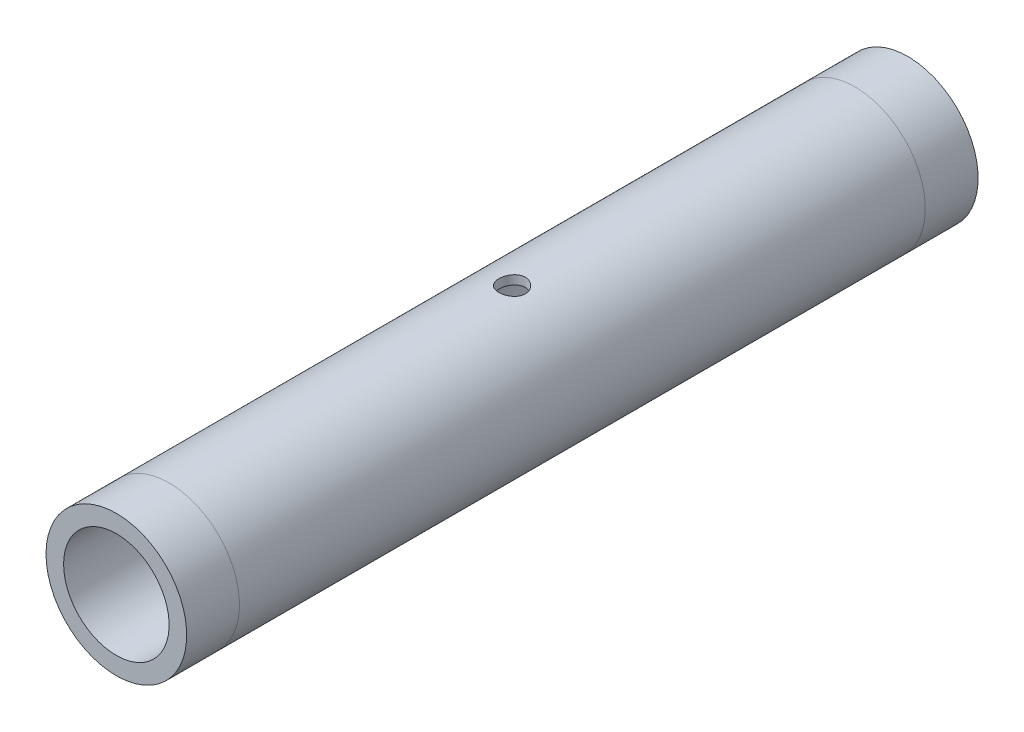
ISO-10303-21;
HEADER;
FILE_DESCRIPTION(('STEP AP214'),'2;1');
FILE_NAME('part.step','',(''),(''),'','','');
FILE_SCHEMA(('AUTOMOTIVE_DESIGN { 1 0 10303 214 1 1 1 1 }'));
ENDSEC;
DATA;
#1=APPLICATION_CONTEXT('core data for automotive mechanical design processes');
#2=APPLICATION_PROTOCOL_DEFINITION('international standard','automotive_design',2000,#1);
#3=PRODUCT_CONTEXT('',#1,'mechanical');
#4=PRODUCT('Part','Part','',(#3));
#5=PRODUCT_RELATED_PRODUCT_CATEGORY('part','',(#4));
#6=PRODUCT_DEFINITION_FORMATION('','',#4);
#7=PRODUCT_DEFINITION_CONTEXT('part definition',#1,'design');
#8=PRODUCT_DEFINITION('design','',#6,#7);
#9=PRODUCT_DEFINITION_SHAPE('','',#8);
#10=(LENGTH_UNIT() NAMED_UNIT(*) SI_UNIT(.MILLI.,.METRE.));
#11=(NAMED_UNIT(*) PLANE_ANGLE_UNIT() SI_UNIT($,.RADIAN.));
#12=(NAMED_UNIT(*) SI_UNIT($,.STERADIAN.) SOLID_ANGLE_UNIT());
#13=UNCERTAINTY_MEASURE_WITH_UNIT(LENGTH_MEASURE(1.E-05),#10,'distance_accuracy_value','');
#14=(GEOMETRIC_REPRESENTATION_CONTEXT(3) GLOBAL_UNCERTAINTY_ASSIGNED_CONTEXT((#13)) GLOBAL_UNIT_ASSIGNED_CONTEXT((#10,
#11,#12)) REPRESENTATION_CONTEXT('',''));
#15=CARTESIAN_POINT('',(0.,0.,0.));
#16=DIRECTION('',(0.,0.,1.));
#17=DIRECTION('',(1.,0.,0.));
#18=AXIS2_PLACEMENT_3D('',#15,#16,#17);
#19=CARTESIAN_POINT('',(0.,0.,0.));
#20=DIRECTION('',(0.,0.,-1.));
#21=DIRECTION('',(-1.,0.,0.));
#22=AXIS2_PLACEMENT_3D('',#19,#20,#21);
#23=CYLINDRICAL_SURFACE('',#22,4.);
#24=CARTESIAN_POINT('',(0.,0.,-22.5));
#25=DIRECTION('',(0.,0.,-1.));
#26=DIRECTION('',(-1.,0.,0.));
#27=AXIS2_PLACEMENT_3D('',#24,#25,#26);
#28=CIRCLE('',#27,4.);
#29=CARTESIAN_POINT('',(-4.,0.,-22.5));
#30=VERTEX_POINT('',#29);
#31=EDGE_CURVE('E68',#30,#30,#28,.T.);
#32=ORIENTED_EDGE('',*,*,#31,.F.);
#33=EDGE_LOOP('',(#32));
#34=FACE_BOUND('',#33,.T.);
#35=CARTESIAN_POINT('',(0.,0.,-19.5));
#36=DIRECTION('',(0.,0.,-1.));
#37=DIRECTION('',(-1.,0.,0.));
#38=AXIS2_PLACEMENT_3D('',#35,#36,#37);
#39=CIRCLE('',#38,4.);
#40=CARTESIAN_POINT('',(-4.,0.,-19.5));
#41=VERTEX_POINT('',#40);
#42=EDGE_CURVE('E11',#41,#41,#39,.T.);
#43=ORIENTED_EDGE('',*,*,#42,.T.);
#44=EDGE_LOOP('',(#43));
#45=FACE_BOUND('',#44,.T.);
#46=ADVANCED_FACE('F46',(#34,#45),#23,.T.);
#47=CARTESIAN_POINT('',(0.,0.,-19.5));
#48=DIRECTION('',(0.,0.,1.));
#49=DIRECTION('',(1.,0.,0.));
#50=AXIS2_PLACEMENT_3D('',#47,#48,#49);
#51=PLANE('',#50);
#52=CARTESIAN_POINT('',(0.,0.,-19.5));
#53=DIRECTION('',(0.,0.,-1.));
#54=DIRECTION('',(-1.,0.,0.));
#55=AXIS2_PLACEMENT_3D('',#52,#53,#54);
#56=CIRCLE('',#55,3.5);
#57=CARTESIAN_POINT('',(-3.5,0.,-19.5));
#58=VERTEX_POINT('',#57);
#59=EDGE_CURVE('E52',#58,#58,#56,.T.);
#60=ORIENTED_EDGE('',*,*,#59,.T.);
#61=EDGE_LOOP('',(#60));
#62=FACE_BOUND('',#61,.T.);
#63=ORIENTED_EDGE('',*,*,#42,.F.);
#64=EDGE_LOOP('',(#63));
#65=FACE_BOUND('',#64,.T.);
#66=ADVANCED_FACE('F75',(#62,#65),#51,.T.);
#67=CARTESIAN_POINT('',(0.,0.,0.));
#68=DIRECTION('',(0.,0.,-1.));
#69=DIRECTION('',(-1.,0.,0.));
#70=AXIS2_PLACEMENT_3D('',#67,#68,#69);
#71=CYLINDRICAL_SURFACE('',#70,3.5);
#72=ORIENTED_EDGE('',*,*,#59,.F.);
#73=EDGE_LOOP('',(#72));
#74=FACE_BOUND('',#73,.T.);
#75=CARTESIAN_POINT('',(0.,0.,-16.5));
#76=DIRECTION('',(0.,0.,-1.));
#77=DIRECTION('',(-1.,0.,0.));
#78=AXIS2_PLACEMENT_3D('',#75,#76,#77);
#79=CIRCLE('',#78,3.5);
#80=CARTESIAN_POINT('',(-3.5,0.,-16.5));
#81=VERTEX_POINT('',#80);
#82=EDGE_CURVE('E56',#81,#81,#79,.T.);
#83=ORIENTED_EDGE('',*,*,#82,.T.);
#84=EDGE_LOOP('',(#83));
#85=FACE_BOUND('',#84,.T.);
#86=ADVANCED_FACE('F79',(#74,#85),#71,.T.);
#87=CARTESIAN_POINT('',(0.,0.,-16.5));
#88=DIRECTION('',(0.,0.,-1.));
#89=DIRECTION('',(-1.,0.,0.));
#90=AXIS2_PLACEMENT_3D('',#87,#88,#89);
#91=PLANE('',#90);
#92=ORIENTED_EDGE('',*,*,#82,.F.);
#93=EDGE_LOOP('',(#92));
#94=FACE_BOUND('',#93,.T.);
#95=CARTESIAN_POINT('',(0.,0.,-16.5));
#96=DIRECTION('',(0.,0.,-1.));
#97=DIRECTION('',(-1.,0.,0.));
#98=AXIS2_PLACEMENT_3D('',#95,#96,#97);
#99=CIRCLE('',#98,3.);
#100=CARTESIAN_POINT('',(-3.,0.,-16.5));
#101=VERTEX_POINT('',#100);
#102=EDGE_CURVE('E60',#101,#101,#99,.T.);
#103=ORIENTED_EDGE('',*,*,#102,.T.);
#104=EDGE_LOOP('',(#103));
#105=FACE_BOUND('',#104,.T.);
#106=ADVANCED_FACE('F83',(#94,#105),#91,.F.);
#107=CARTESIAN_POINT('',(0.,0.,0.));
#108=DIRECTION('',(0.,0.,-1.));
#109=DIRECTION('',(-1.,0.,0.));
#110=AXIS2_PLACEMENT_3D('',#107,#108,#109);
#111=CYLINDRICAL_SURFACE('',#110,3.);
#112=ORIENTED_EDGE('',*,*,#102,.F.);
#113=EDGE_LOOP('',(#112));
#114=FACE_BOUND('',#113,.T.);
#115=CARTESIAN_POINT('',(0.,0.,-22.5));
#116=DIRECTION('',(0.,0.,-1.));
#117=DIRECTION('',(-1.,0.,0.));
#118=AXIS2_PLACEMENT_3D('',#115,#116,#117);
#119=CIRCLE('',#118,3.);
#120=CARTESIAN_POINT('',(-3.,0.,-22.5));
#121=VERTEX_POINT('',#120);
#122=EDGE_CURVE('E65',#121,#121,#119,.T.);
#123=ORIENTED_EDGE('',*,*,#122,.T.);
#124=EDGE_LOOP('',(#123));
#125=FACE_BOUND('',#124,.T.);
#126=ADVANCED_FACE('F90',(#114,#125),#111,.F.);
#127=CARTESIAN_POINT('',(0.,0.,-22.5));
#128=DIRECTION('',(0.,0.,1.));
#129=DIRECTION('',(1.,0.,0.));
#130=AXIS2_PLACEMENT_3D('',#127,#128,#129);
#131=PLANE('',#130);
#132=ORIENTED_EDGE('',*,*,#122,.F.);
#133=EDGE_LOOP('',(#132));
#134=FACE_BOUND('',#133,.T.);
#135=ORIENTED_EDGE('',*,*,#31,.T.);
#136=EDGE_LOOP('',(#135));
#137=FACE_BOUND('',#136,.T.);
#138=ADVANCED_FACE('F72',(#134,#137),#131,.F.);
#139=CLOSED_SHELL('',(#46,#66,#86,#106,#126,#138));
#140=MANIFOLD_SOLID_BREP('B2',#139);
#141=CARTESIAN_POINT('',(0.,0.,0.));
#142=DIRECTION('',(0.,0.,-1.));
#143=DIRECTION('',(-1.,0.,0.));
#144=AXIS2_PLACEMENT_3D('',#141,#142,#143);
#145=CYLINDRICAL_SURFACE('',#144,3.);
#146=CARTESIAN_POINT('',(0.,0.,16.5));
#147=DIRECTION('',(0.,0.,-1.));
#148=DIRECTION('',(-1.,0.,0.));
#149=AXIS2_PLACEMENT_3D('',#146,#147,#148);
#150=CIRCLE('',#149,3.);
#151=CARTESIAN_POINT('',(-3.,0.,16.5));
#152=VERTEX_POINT('',#151);
#153=EDGE_CURVE('E45',#152,#152,#150,.T.);
#154=ORIENTED_EDGE('',*,*,#153,.T.);
#155=EDGE_LOOP('',(#154));
#156=FACE_BOUND('',#155,.T.);
#157=CARTESIAN_POINT('',(0.,0.,22.5));
#158=DIRECTION('',(0.,0.,-1.));
#159=DIRECTION('',(-1.,0.,0.));
#160=AXIS2_PLACEMENT_3D('',#157,#158,#159);
#161=CIRCLE('',#160,3.);
#162=CARTESIAN_POINT('',(-3.,0.,22.5));
#163=VERTEX_POINT('',#162);
#164=EDGE_CURVE('E175',#163,#163,#161,.T.);
#165=ORIENTED_EDGE('',*,*,#164,.F.);
#166=EDGE_LOOP('',(#165));
#167=FACE_BOUND('',#166,.T.);
#168=ADVANCED_FACE('F148',(#156,#167),#145,.F.);
#169=CARTESIAN_POINT('',(0.,0.,16.5));
#170=DIRECTION('',(0.,0.,-1.));
#171=DIRECTION('',(-1.,0.,0.));
#172=AXIS2_PLACEMENT_3D('',#169,#170,#171);
#173=PLANE('',#172);
#174=CARTESIAN_POINT('',(0.,0.,16.5));
#175=DIRECTION('',(0.,0.,-1.));
#176=DIRECTION('',(-1.,0.,0.));
#177=AXIS2_PLACEMENT_3D('',#174,#175,#176);
#178=CIRCLE('',#177,3.5);
#179=CARTESIAN_POINT('',(-3.5,0.,16.5));
#180=VERTEX_POINT('',#179);
#181=EDGE_CURVE('E155',#180,#180,#178,.T.);
#182=ORIENTED_EDGE('',*,*,#181,.T.);
#183=EDGE_LOOP('',(#182));
#184=FACE_BOUND('',#183,.T.);
#185=ORIENTED_EDGE('',*,*,#153,.F.);
#186=EDGE_LOOP('',(#185));
#187=FACE_BOUND('',#186,.T.);
#188=ADVANCED_FACE('F184',(#184,#187),#173,.T.);
#189=CARTESIAN_POINT('',(0.,0.,0.));
#190=DIRECTION('',(0.,0.,-1.));
#191=DIRECTION('',(-1.,0.,0.));
#192=AXIS2_PLACEMENT_3D('',#189,#190,#191);
#193=CYLINDRICAL_SURFACE('',#192,3.5);
#194=ORIENTED_EDGE('',*,*,#181,.F.);
#195=EDGE_LOOP('',(#194));
#196=FACE_BOUND('',#195,.T.);
#197=CARTESIAN_POINT('',(0.,0.,19.5));
#198=DIRECTION('',(0.,0.,-1.));
#199=DIRECTION('',(-1.,0.,0.));
#200=AXIS2_PLACEMENT_3D('',#197,#198,#199);
#201=CIRCLE('',#200,3.5);
#202=CARTESIAN_POINT('',(-3.5,0.,19.5));
#203=VERTEX_POINT('',#202);
#204=EDGE_CURVE('E161',#203,#203,#201,.T.);
#205=ORIENTED_EDGE('',*,*,#204,.T.);
#206=EDGE_LOOP('',(#205));
#207=FACE_BOUND('',#206,.T.);
#208=ADVANCED_FACE('F188',(#196,#207),#193,.T.);
#209=CARTESIAN_POINT('',(0.,0.,19.5));
#210=DIRECTION('',(0.,0.,1.));
#211=DIRECTION('',(1.,0.,0.));
#212=AXIS2_PLACEMENT_3D('',#209,#210,#211);
#213=PLANE('',#212);
#214=ORIENTED_EDGE('',*,*,#204,.F.);
#215=EDGE_LOOP('',(#214));
#216=FACE_BOUND('',#215,.T.);
#217=CARTESIAN_POINT('',(0.,0.,19.5));
#218=DIRECTION('',(0.,0.,-1.));
#219=DIRECTION('',(-1.,0.,0.));
#220=AXIS2_PLACEMENT_3D('',#217,#218,#219);
#221=CIRCLE('',#220,4.);
#222=CARTESIAN_POINT('',(-4.,0.,19.5));
#223=VERTEX_POINT('',#222);
#224=EDGE_CURVE('E166',#223,#223,#221,.T.);
#225=ORIENTED_EDGE('',*,*,#224,.T.);
#226=EDGE_LOOP('',(#225));
#227=FACE_BOUND('',#226,.T.);
#228=ADVANCED_FACE('F192',(#216,#227),#213,.F.);
#229=CARTESIAN_POINT('',(0.,0.,0.));
#230=DIRECTION('',(0.,0.,-1.));
#231=DIRECTION('',(-1.,0.,0.));
#232=AXIS2_PLACEMENT_3D('',#229,#230,#231);
#233=CYLINDRICAL_SURFACE('',#232,4.);
#234=CARTESIAN_POINT('',(0.,0.,22.5));
#235=DIRECTION('',(0.,0.,-1.));
#236=DIRECTION('',(-1.,0.,0.));
#237=AXIS2_PLACEMENT_3D('',#234,#235,#236);
#238=CIRCLE('',#237,4.);
#239=CARTESIAN_POINT('',(-4.,0.,22.5));
#240=VERTEX_POINT('',#239);
#241=EDGE_CURVE('E171',#240,#240,#238,.T.);
#242=ORIENTED_EDGE('',*,*,#241,.T.);
#243=EDGE_LOOP('',(#242));
#244=FACE_BOUND('',#243,.T.);
#245=ORIENTED_EDGE('',*,*,#224,.F.);
#246=EDGE_LOOP('',(#245));
#247=FACE_BOUND('',#246,.T.);
#248=ADVANCED_FACE('F199',(#244,#247),#233,.T.);
#249=CARTESIAN_POINT('',(0.,0.,22.5));
#250=DIRECTION('',(0.,0.,1.));
#251=DIRECTION('',(1.,0.,0.));
#252=AXIS2_PLACEMENT_3D('',#249,#250,#251);
#253=PLANE('',#252);
#254=ORIENTED_EDGE('',*,*,#164,.T.);
#255=EDGE_LOOP('',(#254));
#256=FACE_BOUND('',#255,.T.);
#257=ORIENTED_EDGE('',*,*,#241,.F.);
#258=EDGE_LOOP('',(#257));
#259=FACE_BOUND('',#258,.T.);
#260=ADVANCED_FACE('F180',(#256,#259),#253,.T.);
#261=CLOSED_SHELL('',(#168,#188,#208,#228,#248,#260));
#262=MANIFOLD_SOLID_BREP('B6',#261);
#263=CARTESIAN_POINT('',(0.,0.,0.));
#264=DIRECTION('',(0.,0.,-1.));
#265=DIRECTION('',(-1.,0.,0.));
#266=AXIS2_PLACEMENT_3D('',#263,#264,#265);
#267=CYLINDRICAL_SURFACE('',#266,4.);
#268=CARTESIAN_POINT('',(0.,0.,-19.5));
#269=DIRECTION('',(0.,0.,-1.));
#270=DIRECTION('',(-1.,0.,0.));
#271=AXIS2_PLACEMENT_3D('',#268,#269,#270);
#272=CIRCLE('',#271,4.);
#273=CARTESIAN_POINT('',(-4.,0.,-19.5));
#274=VERTEX_POINT('',#273);
#275=EDGE_CURVE('E147',#274,#274,#272,.T.);
#276=ORIENTED_EDGE('',*,*,#275,.F.);
#277=EDGE_LOOP('',(#276));
#278=FACE_BOUND('',#277,.T.);
#279=CARTESIAN_POINT('',(0.,0.,19.5));
#280=DIRECTION('',(0.,0.,-1.));
#281=DIRECTION('',(-1.,0.,0.));
#282=AXIS2_PLACEMENT_3D('',#279,#280,#281);
#283=CIRCLE('',#282,4.);
#284=CARTESIAN_POINT('',(-4.,0.,19.5));
#285=VERTEX_POINT('',#284);
#286=EDGE_CURVE('E264',#285,#285,#283,.T.);
#287=ORIENTED_EDGE('',*,*,#286,.T.);
#288=EDGE_LOOP('',(#287));
#289=FACE_BOUND('',#288,.T.);
#290=CARTESIAN_POINT('',(0.,-4.,-0.75));
#291=CARTESIAN_POINT('',(0.0417358732327354,-3.99999924416926,-0.749998405205862));
#292=CARTESIAN_POINT('',(0.0834924963650491,-3.99934004960857,-0.74650446169031));
#293=CARTESIAN_POINT('',(0.165829064920899,-3.9967739294526,-0.732630002440827));
#294=CARTESIAN_POINT('',(0.206407987076113,-3.99486595083449,-0.722243674680133));
#295=CARTESIAN_POINT('',(0.285186480925901,-3.99001569382729,-0.694913649370329));
#296=CARTESIAN_POINT('',(0.323388165342672,-3.98707434973241,-0.677975873773729));
#297=CARTESIAN_POINT('',(0.396403986547003,-3.98047855299892,-0.638040561538592));
#298=CARTESIAN_POINT('',(0.431218397238661,-3.97682415809145,-0.615043515427591));
#299=CARTESIAN_POINT('',(0.496891857965251,-3.96915668215252,-0.563350115998163));
#300=CARTESIAN_POINT('',(0.527704477515916,-3.96514017428176,-0.534595277664932));
#301=CARTESIAN_POINT('',(0.584098030676846,-3.95722659229325,-0.47232834545622));
#302=CARTESIAN_POINT('',(0.609678588446207,-3.95332952677264,-0.438815910115357));
#303=CARTESIAN_POINT('',(0.655074993328964,-3.94606275622503,-0.367656955818015));
#304=CARTESIAN_POINT('',(0.674843609848026,-3.94269746943091,-0.329979814841382));
#305=CARTESIAN_POINT('',(0.707752621661415,-3.93692356605994,-0.251765542411605));
#306=CARTESIAN_POINT('',(0.720893588565491,-3.93451486698481,-0.211228657944392));
#307=CARTESIAN_POINT('',(0.740025267517501,-3.93096134787275,-0.128942384542795));
#308=CARTESIAN_POINT('',(0.746096950960195,-3.92980222683202,-0.0872124513982682));
#309=CARTESIAN_POINT('',(0.751169040476732,-3.92883598576381,-0.00331130759587624));
#310=CARTESIAN_POINT('',(0.75017008067687,-3.9290287444938,0.0388598631511506));
#311=CARTESIAN_POINT('',(0.741194898011812,-3.93073146350876,0.121859762633023));
#312=CARTESIAN_POINT('',(0.733310749980224,-3.93222404073667,0.162698857150077));
#313=CARTESIAN_POINT('',(0.710933996981035,-3.93633091642333,0.242464209891304));
#314=CARTESIAN_POINT('',(0.696441111197497,-3.93894526254758,0.28139038675465));
#315=CARTESIAN_POINT('',(0.661168235896499,-3.94501927646294,0.356494339500132));
#316=CARTESIAN_POINT('',(0.640351067662279,-3.94848391911683,0.392654235290404));
#317=CARTESIAN_POINT('',(0.593046844652081,-3.95586485801459,0.461002364270116));
#318=CARTESIAN_POINT('',(0.56655921444633,-3.95978120007761,0.4931901938574));
#319=CARTESIAN_POINT('',(0.508169528426488,-3.96770000636082,0.553212477836229));
#320=CARTESIAN_POINT('',(0.476188718430341,-3.97170285512015,0.580970326225871));
#321=CARTESIAN_POINT('',(0.407984018549413,-3.97928693054159,0.630738620337702));
#322=CARTESIAN_POINT('',(0.371760086127885,-3.98286815297623,0.65274900843521));
#323=CARTESIAN_POINT('',(0.296017494437334,-3.98921269838755,0.690408876935009));
#324=CARTESIAN_POINT('',(0.256494782223247,-3.99197499568145,0.706050389558947));
#325=CARTESIAN_POINT('',(0.175319557699348,-3.9963625270136,0.73045104654608));
#326=CARTESIAN_POINT('',(0.133667272138894,-3.99798788183997,0.739210922022678));
#327=CARTESIAN_POINT('',(0.0500743264516928,-3.9999018032099,0.749493015509135));
#328=CARTESIAN_POINT('',(0.0081470063170679,-4.00020975456139,0.751120195764863));
#329=CARTESIAN_POINT('',(-0.0753806240460917,-3.99950771799114,0.747372260226176));
#330=CARTESIAN_POINT('',(-0.116980950240192,-3.99849779482216,0.741997488467371));
#331=CARTESIAN_POINT('',(-0.198340786609108,-3.99528555750203,0.724485482408316));
#332=CARTESIAN_POINT('',(-0.238112130523031,-3.99309261187016,0.712401358731093));
#333=CARTESIAN_POINT('',(-0.315064315912316,-3.98775921106249,0.681871146610607));
#334=CARTESIAN_POINT('',(-0.352244981297551,-3.98461869155667,0.663424626217107));
#335=CARTESIAN_POINT('',(-0.423408335756607,-3.97769015178833,0.620460935920244));
#336=CARTESIAN_POINT('',(-0.45735163850756,-3.97389543087282,0.595879630731581));
#337=CARTESIAN_POINT('',(-0.520669161632272,-3.96609671744856,0.541430931318821));
#338=CARTESIAN_POINT('',(-0.550042954880433,-3.96209270542344,0.511563043499335));
#339=CARTESIAN_POINT('',(-0.603786479360239,-3.95426237848725,0.446913840544287));
#340=CARTESIAN_POINT('',(-0.628084581092883,-3.95043912930129,0.412072545937307));
#341=CARTESIAN_POINT('',(-0.670483375288934,-3.94346492789266,0.338741187738125));
#342=CARTESIAN_POINT('',(-0.68858429806962,-3.94031395068675,0.300251259814764));
#343=CARTESIAN_POINT('',(-0.717973367564115,-3.93506512104787,0.220897066378732));
#344=CARTESIAN_POINT('',(-0.729294343973931,-3.93296220218439,0.180045310220334));
#345=CARTESIAN_POINT('',(-0.744903396631177,-3.93003601901208,0.0969763887392993));
#346=CARTESIAN_POINT('',(-0.749192266353541,-3.92921261032895,0.0547593780147994));
#347=CARTESIAN_POINT('',(-0.750588810741773,-3.92894599901929,-0.0291241657207564));
#348=CARTESIAN_POINT('',(-0.747809475017494,-3.92948107987147,-0.0707887904784978));
#349=CARTESIAN_POINT('',(-0.735395876894015,-3.93182300329999,-0.153045711022644));
#350=CARTESIAN_POINT('',(-0.72576165544666,-3.93362983827873,-0.19363801321372));
#351=CARTESIAN_POINT('',(-0.699959437916316,-3.9383025401159,-0.27253724239774));
#352=CARTESIAN_POINT('',(-0.683803676986262,-3.94116642297482,-0.310848295672885));
#353=CARTESIAN_POINT('',(-0.645429344561021,-3.9476319377592,-0.384234127120422));
#354=CARTESIAN_POINT('',(-0.623210344740928,-3.9512336218006,-0.419308676422391));
#355=CARTESIAN_POINT('',(-0.572947436697675,-3.95883633053873,-0.485791840021147));
#356=CARTESIAN_POINT('',(-0.544821299321517,-3.96284252676522,-0.517137706283552));
#357=CARTESIAN_POINT('',(-0.483713963371145,-3.97076416959368,-0.574702581232262));
#358=CARTESIAN_POINT('',(-0.450731650945808,-3.97467959513664,-0.600920410490068));
#359=CARTESIAN_POINT('',(-0.380492472535936,-3.98201987984024,-0.64770547631353));
#360=CARTESIAN_POINT('',(-0.343199795320258,-3.98544000495281,-0.668219714245319));
#361=CARTESIAN_POINT('',(-0.265645056826917,-3.99135809690343,-0.702658818302567));
#362=CARTESIAN_POINT('',(-0.225385825852624,-3.99385692939519,-0.716589873523454));
#363=CARTESIAN_POINT('',(-0.154173601412577,-3.99714145353816,-0.734638657209337));
#364=CARTESIAN_POINT('',(-0.123636905125936,-3.99820735439103,-0.7403893151564));
#365=CARTESIAN_POINT('',(-0.0620706235575794,-3.99963689977005,-0.748070531058224));
#366=CARTESIAN_POINT('',(-0.0310410508263549,-4.00000056214903,-0.750001186127954));
#367=CARTESIAN_POINT('',(0.,-4.,-0.75));
#368=B_SPLINE_CURVE_WITH_KNOTS('',3,(#290,#291,#292,#293,#294,#295,#296,#297,#298,#299,#300,
#301,#302,#303,#304,#305,#306,#307,#308,#309,#310,#311,#312,#313,#314,#315,#316,#317,#318,#319,
#320,#321,#322,#323,#324,#325,#326,#327,#328,#329,#330,#331,#332,#333,#334,#335,#336,#337,#338,
#339,#340,#341,#342,#343,#344,#345,#346,#347,#348,#349,#350,#351,#352,#353,#354,#355,#356,#357,
#358,#359,#360,#361,#362,#363,#364,#365,#366,#367),.UNSPECIFIED.,.T.,.F.,(4,2,2,2,2,2,2,2,2,2,2,
2,2,2,2,2,2,2,2,2,2,2,2,2,2,2,2,2,2,2,2,2,2,2,2,2,2,2,4),(0.,0.125094100482462,
0.250293821267726,0.375380635615454,0.500457326684454,0.626875590068152,0.753302931418083,
0.880730952521787,1.00814798155974,1.13409075722668,1.26002223793628,1.38429500306383,
1.50857304923393,1.63359631314765,1.7586322702493,1.88563884232038,2.01264668772474,
2.13981294160849,2.26696568336873,2.39224087038048,2.51750990232292,2.64180116953914,
2.76610087669016,2.89175889008854,3.01742864206549,3.14476718493649,3.27210099477473,
3.3988131390928,3.52551098473256,3.65019626115874,3.77488079270753,3.89933248103846,
4.02379296327712,4.1501168498319,4.27646975631128,4.40396024458157,4.53133063465587,
4.62437172262205,4.7174104451977),.UNSPECIFIED.);
#369=CARTESIAN_POINT('',(0.,-4.,-0.75));
#370=VERTEX_POINT('',#369);
#371=EDGE_CURVE('E290',#370,#370,#368,.T.);
#372=ORIENTED_EDGE('',*,*,#371,.F.);
#373=EDGE_LOOP('',(#372));
#374=FACE_BOUND('',#373,.T.);
#375=CARTESIAN_POINT('',(0.,4.,-0.75));
#376=CARTESIAN_POINT('',(-0.0417358732327354,3.99999924416926,-0.749998405205862));
#377=CARTESIAN_POINT('',(-0.0834924963650493,3.99934004960857,-0.74650446169031));
#378=CARTESIAN_POINT('',(-0.165829064920899,3.9967739294526,-0.732630002440827));
#379=CARTESIAN_POINT('',(-0.206407987076113,3.99486595083449,-0.722243674680133));
#380=CARTESIAN_POINT('',(-0.285186480925901,3.99001569382729,-0.694913649370329));
#381=CARTESIAN_POINT('',(-0.323388165342672,3.98707434973241,-0.677975873773728));
#382=CARTESIAN_POINT('',(-0.396403986547003,3.98047855299892,-0.638040561538592));
#383=CARTESIAN_POINT('',(-0.431218397238662,3.97682415809145,-0.615043515427591));
#384=CARTESIAN_POINT('',(-0.496891857965252,3.96915668215252,-0.563350115998163));
#385=CARTESIAN_POINT('',(-0.527704477515916,3.96514017428176,-0.534595277664932));
#386=CARTESIAN_POINT('',(-0.584098030676846,3.95722659229325,-0.47232834545622));
#387=CARTESIAN_POINT('',(-0.609678588446208,3.95332952677264,-0.438815910115357));
#388=CARTESIAN_POINT('',(-0.655074993328964,3.94606275622503,-0.367656955818014));
#389=CARTESIAN_POINT('',(-0.674843609848027,3.94269746943091,-0.329979814841381));
#390=CARTESIAN_POINT('',(-0.707752621661415,3.93692356605994,-0.251765542411605));
#391=CARTESIAN_POINT('',(-0.720893588565491,3.93451486698481,-0.211228657944391));
#392=CARTESIAN_POINT('',(-0.740025267517501,3.93096134787275,-0.128942384542794));
#393=CARTESIAN_POINT('',(-0.746096950960195,3.92980222683202,-0.0872124513982675));
#394=CARTESIAN_POINT('',(-0.751169040476732,3.92883598576381,-0.00331130759587565));
#395=CARTESIAN_POINT('',(-0.75017008067687,3.9290287444938,0.0388598631511511));
#396=CARTESIAN_POINT('',(-0.741194898011812,3.93073146350876,0.121859762633023));
#397=CARTESIAN_POINT('',(-0.733310749980224,3.93222404073667,0.162698857150077));
#398=CARTESIAN_POINT('',(-0.710933996981035,3.93633091642333,0.242464209891305));
#399=CARTESIAN_POINT('',(-0.696441111197496,3.93894526254758,0.28139038675465));
#400=CARTESIAN_POINT('',(-0.661168235896499,3.94501927646294,0.356494339500133));
#401=CARTESIAN_POINT('',(-0.640351067662279,3.94848391911683,0.392654235290405));
#402=CARTESIAN_POINT('',(-0.593046844652081,3.95586485801459,0.461002364270117));
#403=CARTESIAN_POINT('',(-0.56655921444633,3.95978120007761,0.493190193857401));
#404=CARTESIAN_POINT('',(-0.508169528426488,3.96770000636082,0.55321247783623));
#405=CARTESIAN_POINT('',(-0.476188718430341,3.97170285512015,0.580970326225871));
#406=CARTESIAN_POINT('',(-0.407984018549413,3.97928693054159,0.630738620337703));
#407=CARTESIAN_POINT('',(-0.371760086127884,3.98286815297623,0.652749008435211));
#408=CARTESIAN_POINT('',(-0.296017494437334,3.98921269838755,0.690408876935009));
#409=CARTESIAN_POINT('',(-0.256494782223246,3.99197499568145,0.706050389558948));
#410=CARTESIAN_POINT('',(-0.175319557699348,3.9963625270136,0.73045104654608));
#411=CARTESIAN_POINT('',(-0.133667272138893,3.99798788183997,0.739210922022678));
#412=CARTESIAN_POINT('',(-0.0500743264516919,3.9999018032099,0.749493015509135));
#413=CARTESIAN_POINT('',(-0.0081470063170669,4.00020975456139,0.751120195764863));
#414=CARTESIAN_POINT('',(0.0753806240460927,3.99950771799114,0.747372260226176));
#415=CARTESIAN_POINT('',(0.116980950240193,3.99849779482216,0.74199748846737));
#416=CARTESIAN_POINT('',(0.198340786609109,3.99528555750203,0.724485482408316));
#417=CARTESIAN_POINT('',(0.238112130523032,3.99309261187016,0.712401358731093));
#418=CARTESIAN_POINT('',(0.315064315912317,3.98775921106249,0.681871146610606));
#419=CARTESIAN_POINT('',(0.352244981297552,3.98461869155667,0.663424626217107));
#420=CARTESIAN_POINT('',(0.423408335756607,3.97769015178833,0.620460935920244));
#421=CARTESIAN_POINT('',(0.457351638507561,3.97389543087282,0.59587963073158));
#422=CARTESIAN_POINT('',(0.520669161632273,3.96609671744856,0.541430931318821));
#423=CARTESIAN_POINT('',(0.550042954880433,3.96209270542344,0.511563043499335));
#424=CARTESIAN_POINT('',(0.603786479360239,3.95426237848725,0.446913840544287));
#425=CARTESIAN_POINT('',(0.628084581092883,3.95043912930129,0.412072545937307));
#426=CARTESIAN_POINT('',(0.670483375288934,3.94346492789266,0.338741187738124));
#427=CARTESIAN_POINT('',(0.688584298069621,3.94031395068675,0.300251259814763));
#428=CARTESIAN_POINT('',(0.717973367564115,3.93506512104787,0.220897066378732));
#429=CARTESIAN_POINT('',(0.729294343973931,3.93296220218439,0.180045310220333));
#430=CARTESIAN_POINT('',(0.744903396631177,3.93003601901208,0.0969763887392989));
#431=CARTESIAN_POINT('',(0.749192266353541,3.92921261032895,0.054759378014799));
#432=CARTESIAN_POINT('',(0.750588810741773,3.92894599901929,-0.0291241657207567));
#433=CARTESIAN_POINT('',(0.747809475017494,3.92948107987147,-0.070788790478498));
#434=CARTESIAN_POINT('',(0.735395876894015,3.93182300329999,-0.153045711022644));
#435=CARTESIAN_POINT('',(0.72576165544666,3.93362983827873,-0.193638013213721));
#436=CARTESIAN_POINT('',(0.699959437916316,3.9383025401159,-0.27253724239774));
#437=CARTESIAN_POINT('',(0.683803676986262,3.94116642297482,-0.310848295672885));
#438=CARTESIAN_POINT('',(0.645429344561021,3.9476319377592,-0.384234127120422));
#439=CARTESIAN_POINT('',(0.623210344740928,3.9512336218006,-0.419308676422391));
#440=CARTESIAN_POINT('',(0.572947436697675,3.95883633053873,-0.485791840021147));
#441=CARTESIAN_POINT('',(0.544821299321517,3.96284252676522,-0.517137706283551));
#442=CARTESIAN_POINT('',(0.483713963371145,3.97076416959368,-0.574702581232261));
#443=CARTESIAN_POINT('',(0.450731650945808,3.97467959513664,-0.600920410490069));
#444=CARTESIAN_POINT('',(0.380492472535936,3.98201987984024,-0.64770547631353));
#445=CARTESIAN_POINT('',(0.343199795320258,3.98544000495281,-0.668219714245319));
#446=CARTESIAN_POINT('',(0.265645056826917,3.99135809690343,-0.702658818302568));
#447=CARTESIAN_POINT('',(0.225385825852624,3.99385692939519,-0.716589873523454));
#448=CARTESIAN_POINT('',(0.154173601412577,3.99714145353816,-0.734638657209337));
#449=CARTESIAN_POINT('',(0.123636905125935,3.99820735439103,-0.740389315156401));
#450=CARTESIAN_POINT('',(0.0620706235575789,3.99963689977005,-0.748070531058224));
#451=CARTESIAN_POINT('',(0.0310410508263547,4.00000056214903,-0.750001186127954));
#452=CARTESIAN_POINT('',(0.,4.,-0.75));
#453=B_SPLINE_CURVE_WITH_KNOTS('',3,(#375,#376,#377,#378,#379,#380,#381,#382,#383,#384,#385,
#386,#387,#388,#389,#390,#391,#392,#393,#394,#395,#396,#397,#398,#399,#400,#401,#402,#403,#404,
#405,#406,#407,#408,#409,#410,#411,#412,#413,#414,#415,#416,#417,#418,#419,#420,#421,#422,#423,
#424,#425,#426,#427,#428,#429,#430,#431,#432,#433,#434,#435,#436,#437,#438,#439,#440,#441,#442,
#443,#444,#445,#446,#447,#448,#449,#450,#451,#452),.UNSPECIFIED.,.T.,.F.,(4,2,2,2,2,2,2,2,2,2,2,
2,2,2,2,2,2,2,2,2,2,2,2,2,2,2,2,2,2,2,2,2,2,2,2,2,2,2,4),(0.,0.125094100482462,
0.250293821267726,0.375380635615454,0.500457326684454,0.626875590068153,0.753302931418083,
0.880730952521788,1.00814798155974,1.13409075722668,1.26002223793628,1.38429500306383,
1.50857304923393,1.63359631314765,1.7586322702493,1.88563884232038,2.01264668772474,
2.13981294160849,2.26696568336873,2.39224087038048,2.51750990232292,2.64180116953914,
2.76610087669016,2.89175889008854,3.01742864206549,3.14476718493649,3.27210099477473,
3.3988131390928,3.52551098473256,3.65019626115874,3.77488079270753,3.89933248103846,
4.02379296327712,4.1501168498319,4.27646975631128,4.40396024458157,4.53133063465587,
4.62437172262205,4.7174104451977),.UNSPECIFIED.);
#454=CARTESIAN_POINT('',(0.,4.,-0.75));
#455=VERTEX_POINT('',#454);
#456=EDGE_CURVE('E294',#455,#455,#453,.T.);
#457=ORIENTED_EDGE('',*,*,#456,.F.);
#458=EDGE_LOOP('',(#457));
#459=FACE_BOUND('',#458,.T.);
#460=ADVANCED_FACE('F252',(#278,#289,#374,#459),#267,.T.);
#461=CARTESIAN_POINT('',(0.,0.,0.));
#462=DIRECTION('',(0.,0.,-1.));
#463=DIRECTION('',(-1.,0.,0.));
#464=AXIS2_PLACEMENT_3D('',#461,#462,#463);
#465=CYLINDRICAL_SURFACE('',#464,3.5);
#466=CARTESIAN_POINT('',(0.,-3.5,-0.75));
#467=CARTESIAN_POINT('',(0.0416179430453083,-3.49999923021613,-0.749998550212849));
#468=CARTESIAN_POINT('',(0.0832535978001373,-3.49925012974855,-0.746524195806072));
#469=CARTESIAN_POINT('',(0.165343672146664,-3.49633414913864,-0.732732171573204));
#470=CARTESIAN_POINT('',(0.205797201785595,-3.4941662281855,-0.722409477902533));
#471=CARTESIAN_POINT('',(0.284324661908868,-3.48865415894413,-0.695257817695982));
#472=CARTESIAN_POINT('',(0.322400981723278,-3.48531121483585,-0.678435510309341));
#473=CARTESIAN_POINT('',(0.395189088980393,-3.47781053408985,-0.638782956914368));
#474=CARTESIAN_POINT('',(0.429900990873684,-3.4736528251833,-0.615952915375029));
#475=CARTESIAN_POINT('',(0.495512395267615,-3.46490684623155,-0.564559850163246));
#476=CARTESIAN_POINT('',(0.526352517097226,-3.4603134157163,-0.535921889050737));
#477=CARTESIAN_POINT('',(0.582830211947175,-3.45125034907072,-0.473886842157402));
#478=CARTESIAN_POINT('',(0.608467335754541,-3.44678072365815,-0.440489345874371));
#479=CARTESIAN_POINT('',(0.654071021899043,-3.43842058023612,-0.369447123569784));
#480=CARTESIAN_POINT('',(0.673974791675044,-3.4345366817218,-0.331761241121895));
#481=CARTESIAN_POINT('',(0.707144118455738,-3.42786162779269,-0.253482773116581));
#482=CARTESIAN_POINT('',(0.720410435008578,-3.42507034735355,-0.212890520753713));
#483=CARTESIAN_POINT('',(0.739732872112272,-3.42094904463155,-0.130594456705963));
#484=CARTESIAN_POINT('',(0.745893898741712,-3.41959778448243,-0.0889163621680677));
#485=CARTESIAN_POINT('',(0.751156976032885,-3.41844569922553,-0.00509788374650279));
#486=CARTESIAN_POINT('',(0.750259858323147,-3.41864469145864,0.0370424450899732));
#487=CARTESIAN_POINT('',(0.741516631704307,-3.42055138301916,0.119812343966896));
#488=CARTESIAN_POINT('',(0.733791993247041,-3.42223270841081,0.160455444550076));
#489=CARTESIAN_POINT('',(0.711805271493384,-3.42687296687894,0.239855120144671));
#490=CARTESIAN_POINT('',(0.697542834682329,-3.42983196904201,0.27861159301616));
#491=CARTESIAN_POINT('',(0.662772755379956,-3.43672040377862,0.353481436436669));
#492=CARTESIAN_POINT('',(0.642218054864149,-3.44065710491682,0.389572256356276));
#493=CARTESIAN_POINT('',(0.595480036419966,-3.44905286250644,0.457837582478979));
#494=CARTESIAN_POINT('',(0.569295980517811,-3.45351198740948,0.490011574343101));
#495=CARTESIAN_POINT('',(0.511397713776602,-3.46256359196939,0.550229677836699));
#496=CARTESIAN_POINT('',(0.479580116982205,-3.46715691986089,0.578174353292369));
#497=CARTESIAN_POINT('',(0.411658653134548,-3.4758750874853,0.62834686684483));
#498=CARTESIAN_POINT('',(0.3755547143877,-3.47999991937986,0.650574609300194));
#499=CARTESIAN_POINT('',(0.29996673102498,-3.48732889267001,0.688705339953465));
#500=CARTESIAN_POINT('',(0.260476129431741,-3.49053119321677,0.704595706288991));
#501=CARTESIAN_POINT('',(0.179301573342853,-3.49564054622667,0.729487824160543));
#502=CARTESIAN_POINT('',(0.137617925566835,-3.49754777930192,0.738490536281658));
#503=CARTESIAN_POINT('',(0.0540938354183144,-3.49982653173904,0.749208107071712));
#504=CARTESIAN_POINT('',(0.0122715886358072,-3.50022668260533,0.75105885644089));
#505=CARTESIAN_POINT('',(-0.0710844868252026,-3.49952624467985,0.747787714437418));
#506=CARTESIAN_POINT('',(-0.112618334063628,-3.49842575337849,0.742666276018529));
#507=CARTESIAN_POINT('',(-0.193771268991403,-3.49486571522633,0.725708878169149));
#508=CARTESIAN_POINT('',(-0.233405856454239,-3.4924205252273,0.713943815263733));
#509=CARTESIAN_POINT('',(-0.310139225236709,-3.48644462210755,0.684111528502589));
#510=CARTESIAN_POINT('',(-0.34723779629387,-3.48291381911119,0.666043782844173));
#511=CARTESIAN_POINT('',(-0.418410698982377,-3.475087521952,0.623833228469837));
#512=CARTESIAN_POINT('',(-0.45243628755557,-3.47078215677138,0.599610102545136));
#513=CARTESIAN_POINT('',(-0.515988462761798,-3.46190516517424,0.545882587555632));
#514=CARTESIAN_POINT('',(-0.545514489345998,-3.45733350571049,0.516377542056279));
#515=CARTESIAN_POINT('',(-0.599763555289945,-3.44834086353162,0.452301314906432));
#516=CARTESIAN_POINT('',(-0.624392686275783,-3.44392396110642,0.417649950388948));
#517=CARTESIAN_POINT('',(-0.667482076930202,-3.43583327279841,0.344622701761003));
#518=CARTESIAN_POINT('',(-0.685942599568528,-3.43215945524027,0.306246976511254));
#519=CARTESIAN_POINT('',(-0.716048706242739,-3.42600504903695,0.227063850502698));
#520=CARTESIAN_POINT('',(-0.727731993206375,-3.42351787291483,0.186271321784666));
#521=CARTESIAN_POINT('',(-0.744063480426676,-3.42000593354209,0.103242208083182));
#522=CARTESIAN_POINT('',(-0.748712753901288,-3.41898094719853,0.0610058443993402));
#523=CARTESIAN_POINT('',(-0.750799999630202,-3.41852309424078,-0.0227661715876215));
#524=CARTESIAN_POINT('',(-0.748386736291556,-3.41905738259271,-0.0642980074902893));
#525=CARTESIAN_POINT('',(-0.736748947031653,-3.42158381592415,-0.146348621066293));
#526=CARTESIAN_POINT('',(-0.727524494789895,-3.42357594513357,-0.186867409693287));
#527=CARTESIAN_POINT('',(-0.702596729702168,-3.42877790552079,-0.265629328934584));
#528=CARTESIAN_POINT('',(-0.686914235854434,-3.43198382112352,-0.303879324332146));
#529=CARTESIAN_POINT('',(-0.649533757978003,-3.43925382295325,-0.377227686253425));
#530=CARTESIAN_POINT('',(-0.627835176507498,-3.44331799440181,-0.412325739307522));
#531=CARTESIAN_POINT('',(-0.578541451746518,-3.45194527796616,-0.479109096862683));
#532=CARTESIAN_POINT('',(-0.550839937106183,-3.45651654969463,-0.510714847973489));
#533=CARTESIAN_POINT('',(-0.49054327730981,-3.46558724899847,-0.56887813126023));
#534=CARTESIAN_POINT('',(-0.457947004692798,-3.47008665975648,-0.595434497156103));
#535=CARTESIAN_POINT('',(-0.388301573634359,-3.47857245524494,-0.643057979752781));
#536=CARTESIAN_POINT('',(-0.351202423004821,-3.48255182285313,-0.664053303115489));
#537=CARTESIAN_POINT('',(-0.273925080470299,-3.48947913052009,-0.699477264453091));
#538=CARTESIAN_POINT('',(-0.23374955293194,-3.49242795106171,-0.713911511292518));
#539=CARTESIAN_POINT('',(-0.161267608776602,-3.49642424230886,-0.733176092565575));
#540=CARTESIAN_POINT('',(-0.129358602772989,-3.49775695944132,-0.739473216990016));
#541=CARTESIAN_POINT('',(-0.0649699804269229,-3.4995451207736,-0.747885650855834));
#542=CARTESIAN_POINT('',(-0.0324903875443723,-3.50000060095657,-0.75000113182303));
#543=CARTESIAN_POINT('',(0.,-3.5,-0.75));
#544=B_SPLINE_CURVE_WITH_KNOTS('',3,(#466,#467,#468,#469,#470,#471,#472,#473,#474,#475,#476,
#477,#478,#479,#480,#481,#482,#483,#484,#485,#486,#487,#488,#489,#490,#491,#492,#493,#494,#495,
#496,#497,#498,#499,#500,#501,#502,#503,#504,#505,#506,#507,#508,#509,#510,#511,#512,#513,#514,
#515,#516,#517,#518,#519,#520,#521,#522,#523,#524,#525,#526,#527,#528,#529,#530,#531,#532,#533,
#534,#535,#536,#537,#538,#539,#540,#541,#542,#543),.UNSPECIFIED.,.T.,.F.,(4,2,2,2,2,2,2,2,2,2,2,
2,2,2,2,2,2,2,2,2,2,2,2,2,2,2,2,2,2,2,2,2,2,2,2,2,2,2,4),(0.,0.124734918256041,
0.249561441609968,0.374260412212801,0.498955139322943,0.62537480940866,0.751805389592532,
0.879572146072552,1.00732427838745,1.13316504062333,1.25899097584582,1.38262237726464,
1.50626046452284,1.63084678082984,1.75544943960445,1.88263505525145,2.00982279851175,
2.13726260569903,2.26468463628172,2.38967332852092,2.51465390115715,2.63832530294634,
2.76200694599217,2.88739366933901,3.01279598652242,3.14041031641767,3.26801920537903,
3.39491120204237,3.52178383614593,3.64600340270147,3.77022162554135,3.89404249853393,
4.01787567225812,4.14411475077057,4.27038295198557,4.39820955178611,4.52592667005135,
4.62330899566147,4.72068732668668),.UNSPECIFIED.);
#545=CARTESIAN_POINT('',(0.,-3.5,-0.75));
#546=VERTEX_POINT('',#545);
#547=EDGE_CURVE('E273',#546,#546,#544,.T.);
#548=ORIENTED_EDGE('',*,*,#547,.T.);
#549=EDGE_LOOP('',(#548));
#550=FACE_BOUND('',#549,.T.);
#551=CARTESIAN_POINT('',(0.,0.,-19.5));
#552=DIRECTION('',(0.,0.,-1.));
#553=DIRECTION('',(-1.,0.,0.));
#554=AXIS2_PLACEMENT_3D('',#551,#552,#553);
#555=CIRCLE('',#554,3.5);
#556=CARTESIAN_POINT('',(-3.5,0.,-19.5));
#557=VERTEX_POINT('',#556);
#558=EDGE_CURVE('E322',#557,#557,#555,.T.);
#559=ORIENTED_EDGE('',*,*,#558,.T.);
#560=EDGE_LOOP('',(#559));
#561=FACE_BOUND('',#560,.T.);
#562=CARTESIAN_POINT('',(0.,0.,19.5));
#563=DIRECTION('',(0.,0.,-1.));
#564=DIRECTION('',(-1.,0.,0.));
#565=AXIS2_PLACEMENT_3D('',#562,#563,#564);
#566=CIRCLE('',#565,3.5);
#567=CARTESIAN_POINT('',(-3.5,0.,19.5));
#568=VERTEX_POINT('',#567);
#569=EDGE_CURVE('E270',#568,#568,#566,.T.);
#570=ORIENTED_EDGE('',*,*,#569,.F.);
#571=EDGE_LOOP('',(#570));
#572=FACE_BOUND('',#571,.T.);
#573=CARTESIAN_POINT('',(0.,3.5,-0.75));
#574=CARTESIAN_POINT('',(-0.0416179430453083,3.49999923021613,-0.749998550212849));
#575=CARTESIAN_POINT('',(-0.0832535978001373,3.49925012974855,-0.746524195806072));
#576=CARTESIAN_POINT('',(-0.165343672146664,3.49633414913864,-0.732732171573204));
#577=CARTESIAN_POINT('',(-0.205797201785595,3.4941662281855,-0.722409477902533));
#578=CARTESIAN_POINT('',(-0.284324661908868,3.48865415894413,-0.695257817695982));
#579=CARTESIAN_POINT('',(-0.322400981723278,3.48531121483585,-0.678435510309341));
#580=CARTESIAN_POINT('',(-0.395189088980393,3.47781053408985,-0.638782956914368));
#581=CARTESIAN_POINT('',(-0.429900990873684,3.4736528251833,-0.615952915375029));
#582=CARTESIAN_POINT('',(-0.495512395267615,3.46490684623155,-0.564559850163246));
#583=CARTESIAN_POINT('',(-0.526352517097226,3.4603134157163,-0.535921889050737));
#584=CARTESIAN_POINT('',(-0.582830211947175,3.45125034907072,-0.473886842157402));
#585=CARTESIAN_POINT('',(-0.608467335754541,3.44678072365815,-0.440489345874371));
#586=CARTESIAN_POINT('',(-0.654071021899043,3.43842058023612,-0.369447123569784));
#587=CARTESIAN_POINT('',(-0.673974791675044,3.4345366817218,-0.331761241121895));
#588=CARTESIAN_POINT('',(-0.707144118455738,3.42786162779269,-0.253482773116581));
#589=CARTESIAN_POINT('',(-0.720410435008578,3.42507034735355,-0.212890520753713));
#590=CARTESIAN_POINT('',(-0.739732872112272,3.42094904463155,-0.130594456705963));
#591=CARTESIAN_POINT('',(-0.745893898741712,3.41959778448243,-0.0889163621680677));
#592=CARTESIAN_POINT('',(-0.751156976032885,3.41844569922553,-0.00509788374650279));
#593=CARTESIAN_POINT('',(-0.750259858323147,3.41864469145864,0.0370424450899732));
#594=CARTESIAN_POINT('',(-0.741516631704307,3.42055138301916,0.119812343966896));
#595=CARTESIAN_POINT('',(-0.733791993247041,3.42223270841081,0.160455444550076));
#596=CARTESIAN_POINT('',(-0.711805271493384,3.42687296687894,0.239855120144671));
#597=CARTESIAN_POINT('',(-0.697542834682329,3.42983196904201,0.27861159301616));
#598=CARTESIAN_POINT('',(-0.662772755379956,3.43672040377862,0.353481436436669));
#599=CARTESIAN_POINT('',(-0.642218054864149,3.44065710491682,0.389572256356276));
#600=CARTESIAN_POINT('',(-0.595480036419966,3.44905286250644,0.457837582478979));
#601=CARTESIAN_POINT('',(-0.569295980517811,3.45351198740948,0.490011574343101));
#602=CARTESIAN_POINT('',(-0.511397713776602,3.46256359196939,0.550229677836699));
#603=CARTESIAN_POINT('',(-0.479580116982205,3.46715691986089,0.578174353292369));
#604=CARTESIAN_POINT('',(-0.411658653134548,3.4758750874853,0.62834686684483));
#605=CARTESIAN_POINT('',(-0.3755547143877,3.47999991937986,0.650574609300194));
#606=CARTESIAN_POINT('',(-0.29996673102498,3.48732889267001,0.688705339953465));
#607=CARTESIAN_POINT('',(-0.260476129431741,3.49053119321677,0.704595706288991));
#608=CARTESIAN_POINT('',(-0.179301573342853,3.49564054622667,0.729487824160543));
#609=CARTESIAN_POINT('',(-0.137617925566835,3.49754777930192,0.738490536281658));
#610=CARTESIAN_POINT('',(-0.0540938354183144,3.49982653173904,0.749208107071712));
#611=CARTESIAN_POINT('',(-0.0122715886358072,3.50022668260533,0.75105885644089));
#612=CARTESIAN_POINT('',(0.0710844868252026,3.49952624467985,0.747787714437418));
#613=CARTESIAN_POINT('',(0.112618334063628,3.49842575337849,0.742666276018529));
#614=CARTESIAN_POINT('',(0.193771268991403,3.49486571522633,0.725708878169149));
#615=CARTESIAN_POINT('',(0.233405856454239,3.4924205252273,0.713943815263733));
#616=CARTESIAN_POINT('',(0.310139225236709,3.48644462210755,0.684111528502589));
#617=CARTESIAN_POINT('',(0.34723779629387,3.48291381911119,0.666043782844173));
#618=CARTESIAN_POINT('',(0.418410698982377,3.475087521952,0.623833228469837));
#619=CARTESIAN_POINT('',(0.45243628755557,3.47078215677138,0.599610102545136));
#620=CARTESIAN_POINT('',(0.515988462761798,3.46190516517424,0.545882587555632));
#621=CARTESIAN_POINT('',(0.545514489345998,3.45733350571049,0.516377542056279));
#622=CARTESIAN_POINT('',(0.599763555289945,3.44834086353162,0.452301314906432));
#623=CARTESIAN_POINT('',(0.624392686275783,3.44392396110642,0.417649950388948));
#624=CARTESIAN_POINT('',(0.667482076930202,3.43583327279841,0.344622701761003));
#625=CARTESIAN_POINT('',(0.685942599568528,3.43215945524027,0.306246976511254));
#626=CARTESIAN_POINT('',(0.716048706242739,3.42600504903695,0.227063850502698));
#627=CARTESIAN_POINT('',(0.727731993206375,3.42351787291483,0.186271321784666));
#628=CARTESIAN_POINT('',(0.744063480426676,3.42000593354209,0.103242208083182));
#629=CARTESIAN_POINT('',(0.748712753901288,3.41898094719853,0.0610058443993402));
#630=CARTESIAN_POINT('',(0.750799999630202,3.41852309424078,-0.0227661715876215));
#631=CARTESIAN_POINT('',(0.748386736291556,3.41905738259271,-0.0642980074902893));
#632=CARTESIAN_POINT('',(0.736748947031653,3.42158381592415,-0.146348621066293));
#633=CARTESIAN_POINT('',(0.727524494789895,3.42357594513357,-0.186867409693287));
#634=CARTESIAN_POINT('',(0.702596729702168,3.42877790552079,-0.265629328934584));
#635=CARTESIAN_POINT('',(0.686914235854434,3.43198382112352,-0.303879324332146));
#636=CARTESIAN_POINT('',(0.649533757978003,3.43925382295325,-0.377227686253425));
#637=CARTESIAN_POINT('',(0.627835176507498,3.44331799440181,-0.412325739307522));
#638=CARTESIAN_POINT('',(0.578541451746518,3.45194527796616,-0.479109096862683));
#639=CARTESIAN_POINT('',(0.550839937106183,3.45651654969463,-0.510714847973489));
#640=CARTESIAN_POINT('',(0.49054327730981,3.46558724899847,-0.56887813126023));
#641=CARTESIAN_POINT('',(0.457947004692798,3.47008665975648,-0.595434497156103));
#642=CARTESIAN_POINT('',(0.388301573634359,3.47857245524494,-0.643057979752781));
#643=CARTESIAN_POINT('',(0.351202423004821,3.48255182285313,-0.664053303115489));
#644=CARTESIAN_POINT('',(0.273925080470299,3.48947913052009,-0.699477264453091));
#645=CARTESIAN_POINT('',(0.23374955293194,3.49242795106171,-0.713911511292518));
#646=CARTESIAN_POINT('',(0.161267608776602,3.49642424230886,-0.733176092565575));
#647=CARTESIAN_POINT('',(0.129358602772989,3.49775695944132,-0.739473216990016));
#648=CARTESIAN_POINT('',(0.0649699804269229,3.4995451207736,-0.747885650855834));
#649=CARTESIAN_POINT('',(0.0324903875443723,3.50000060095657,-0.75000113182303));
#650=CARTESIAN_POINT('',(0.,3.5,-0.75));
#651=B_SPLINE_CURVE_WITH_KNOTS('',3,(#573,#574,#575,#576,#577,#578,#579,#580,#581,#582,#583,
#584,#585,#586,#587,#588,#589,#590,#591,#592,#593,#594,#595,#596,#597,#598,#599,#600,#601,#602,
#603,#604,#605,#606,#607,#608,#609,#610,#611,#612,#613,#614,#615,#616,#617,#618,#619,#620,#621,
#622,#623,#624,#625,#626,#627,#628,#629,#630,#631,#632,#633,#634,#635,#636,#637,#638,#639,#640,
#641,#642,#643,#644,#645,#646,#647,#648,#649,#650),.UNSPECIFIED.,.T.,.F.,(4,2,2,2,2,2,2,2,2,2,2,
2,2,2,2,2,2,2,2,2,2,2,2,2,2,2,2,2,2,2,2,2,2,2,2,2,2,2,4),(0.,0.124734918256041,
0.249561441609968,0.374260412212801,0.498955139322943,0.62537480940866,0.751805389592532,
0.879572146072552,1.00732427838745,1.13316504062333,1.25899097584582,1.38262237726464,
1.50626046452284,1.63084678082984,1.75544943960445,1.88263505525145,2.00982279851175,
2.13726260569903,2.26468463628172,2.38967332852092,2.51465390115715,2.63832530294634,
2.76200694599217,2.88739366933901,3.01279598652242,3.14041031641767,3.26801920537903,
3.39491120204237,3.52178383614593,3.64600340270147,3.77022162554135,3.89404249853393,
4.01787567225812,4.14411475077057,4.27038295198557,4.39820955178611,4.52592667005135,
4.62330899566147,4.72068732668668),.UNSPECIFIED.);
#652=CARTESIAN_POINT('',(0.,3.5,-0.75));
#653=VERTEX_POINT('',#652);
#654=EDGE_CURVE('E256',#653,#653,#651,.T.);
#655=ORIENTED_EDGE('',*,*,#654,.T.);
#656=EDGE_LOOP('',(#655));
#657=FACE_BOUND('',#656,.T.);
#658=ADVANCED_FACE('F277',(#550,#561,#572,#657),#465,.F.);
#659=CARTESIAN_POINT('',(0.,0.,-19.5));
#660=DIRECTION('',(0.,0.,1.));
#661=DIRECTION('',(1.,0.,0.));
#662=AXIS2_PLACEMENT_3D('',#659,#660,#661);
#663=PLANE('',#662);
#664=ORIENTED_EDGE('',*,*,#558,.F.);
#665=EDGE_LOOP('',(#664));
#666=FACE_BOUND('',#665,.T.);
#667=ORIENTED_EDGE('',*,*,#275,.T.);
#668=EDGE_LOOP('',(#667));
#669=FACE_BOUND('',#668,.T.);
#670=ADVANCED_FACE('F254',(#666,#669),#663,.F.);
#671=CARTESIAN_POINT('',(0.,0.,19.5));
#672=DIRECTION('',(0.,0.,1.));
#673=DIRECTION('',(1.,0.,0.));
#674=AXIS2_PLACEMENT_3D('',#671,#672,#673);
#675=PLANE('',#674);
#676=ORIENTED_EDGE('',*,*,#569,.T.);
#677=EDGE_LOOP('',(#676));
#678=FACE_BOUND('',#677,.T.);
#679=ORIENTED_EDGE('',*,*,#286,.F.);
#680=EDGE_LOOP('',(#679));
#681=FACE_BOUND('',#680,.T.);
#682=ADVANCED_FACE('F301',(#678,#681),#675,.T.);
#683=CARTESIAN_POINT('',(0.,4.,0.));
#684=DIRECTION('',(0.,-1.,0.));
#685=DIRECTION('',(0.,0.,-1.));
#686=AXIS2_PLACEMENT_3D('',#683,#684,#685);
#687=CYLINDRICAL_SURFACE('',#686,0.75);
#688=ORIENTED_EDGE('',*,*,#547,.F.);
#689=EDGE_LOOP('',(#688));
#690=FACE_BOUND('',#689,.T.);
#691=ORIENTED_EDGE('',*,*,#371,.T.);
#692=EDGE_LOOP('',(#691));
#693=FACE_BOUND('',#692,.T.);
#694=ADVANCED_FACE('F283',(#690,#693),#687,.F.);
#695=ORIENTED_EDGE('',*,*,#654,.F.);
#696=EDGE_LOOP('',(#695));
#697=FACE_BOUND('',#696,.T.);
#698=ORIENTED_EDGE('',*,*,#456,.T.);
#699=EDGE_LOOP('',(#698));
#700=FACE_BOUND('',#699,.T.);
#701=ADVANCED_FACE('F280',(#697,#700),#687,.F.);
#702=CLOSED_SHELL('',(#460,#658,#670,#682,#694,#701));
#703=MANIFOLD_SOLID_BREP('B40',#702);
#704=ADVANCED_BREP_SHAPE_REPRESENTATION('',(#18,#140,#262,#703),#14);
#705=SHAPE_DEFINITION_REPRESENTATION(#9,#704);
ENDSEC;
END-ISO-10303-21;
